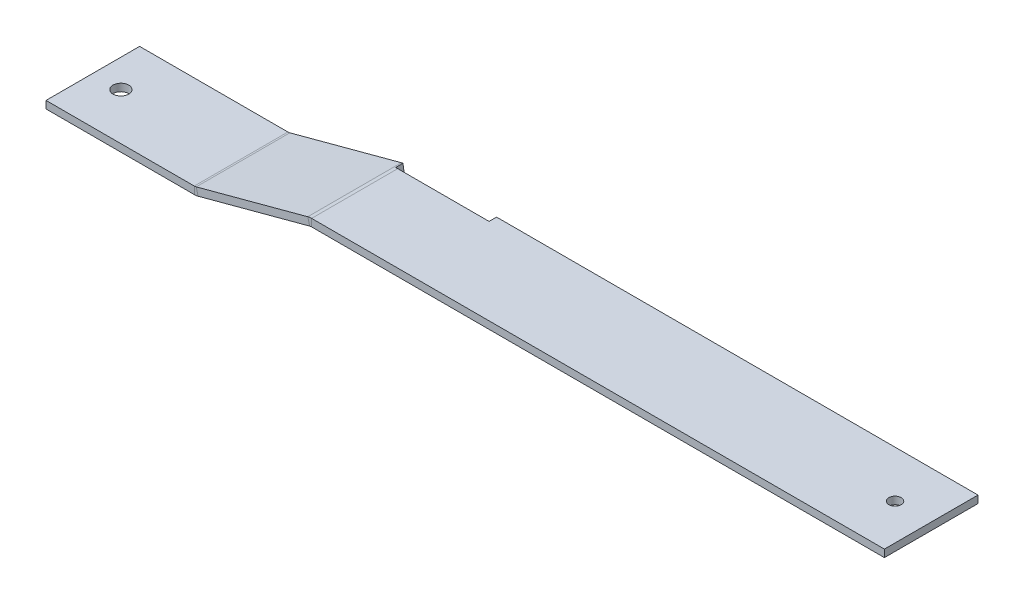
ISO-10303-21;
HEADER;
FILE_DESCRIPTION(('STEP AP214'),'2;1');
FILE_NAME('part.step','',(''),(''),'','','');
FILE_SCHEMA(('AUTOMOTIVE_DESIGN { 1 0 10303 214 1 1 1 1 }'));
ENDSEC;
DATA;
#1=APPLICATION_CONTEXT('core data for automotive mechanical design processes');
#2=APPLICATION_PROTOCOL_DEFINITION('international standard','automotive_design',2000,#1);
#3=PRODUCT_CONTEXT('',#1,'mechanical');
#4=PRODUCT('Part','Part','',(#3));
#5=PRODUCT_RELATED_PRODUCT_CATEGORY('part','',(#4));
#6=PRODUCT_DEFINITION_FORMATION('','',#4);
#7=PRODUCT_DEFINITION_CONTEXT('part definition',#1,'design');
#8=PRODUCT_DEFINITION('design','',#6,#7);
#9=PRODUCT_DEFINITION_SHAPE('','',#8);
#10=(LENGTH_UNIT() NAMED_UNIT(*) SI_UNIT(.MILLI.,.METRE.));
#11=(NAMED_UNIT(*) PLANE_ANGLE_UNIT() SI_UNIT($,.RADIAN.));
#12=(NAMED_UNIT(*) SI_UNIT($,.STERADIAN.) SOLID_ANGLE_UNIT());
#13=UNCERTAINTY_MEASURE_WITH_UNIT(LENGTH_MEASURE(1.E-05),#10,'distance_accuracy_value','');
#14=(GEOMETRIC_REPRESENTATION_CONTEXT(3) GLOBAL_UNCERTAINTY_ASSIGNED_CONTEXT((#13)) GLOBAL_UNIT_ASSIGNED_CONTEXT((#10,
#11,#12)) REPRESENTATION_CONTEXT('',''));
#15=CARTESIAN_POINT('',(0.,0.,0.));
#16=DIRECTION('',(0.,0.,1.));
#17=DIRECTION('',(1.,0.,0.));
#18=AXIS2_PLACEMENT_3D('',#15,#16,#17);
#19=CARTESIAN_POINT('',(-41.555842431062,4.205383129343,-12.5));
#20=DIRECTION('',(0.,0.,1.));
#21=DIRECTION('',(1.,0.,0.));
#22=AXIS2_PLACEMENT_3D('',#19,#20,#21);
#23=PLANE('',#22);
#24=CARTESIAN_POINT('',(-41.555842431062,4.205383129343,-12.5));
#25=DIRECTION('',(0.,0.,1.));
#26=DIRECTION('',(1.,0.,0.));
#27=AXIS2_PLACEMENT_3D('',#24,#25,#26);
#28=CIRCLE('',#27,3.98);
#29=CARTESIAN_POINT('',(-42.58594223057,8.04976791797349,-12.5));
#30=VERTEX_POINT('',#29);
#31=CARTESIAN_POINT('',(-42.1521992946053,8.14045091672669,-12.5));
#32=VERTEX_POINT('',#31);
#33=EDGE_CURVE('E178',#30,#32,#28,.F.);
#34=ORIENTED_EDGE('',*,*,#33,.T.);
#35=DIRECTION('',(0.149838407925458,-0.988710499342636,0.));
#36=VECTOR('',#35,1.);
#37=CARTESIAN_POINT('',(-41.8555192469129,6.18280412802827,-12.5));
#38=LINE('',#37,#36);
#39=CARTESIAN_POINT('',(-41.8555192469129,6.18280412802827,-12.5));
#40=VERTEX_POINT('',#39);
#41=EDGE_CURVE('E163',#32,#40,#38,.T.);
#42=ORIENTED_EDGE('',*,*,#41,.T.);
#43=CARTESIAN_POINT('',(-41.555842431062,4.205383129343,-12.5));
#44=DIRECTION('',(0.,0.,-1.));
#45=DIRECTION('',(1.,0.,0.));
#46=AXIS2_PLACEMENT_3D('',#43,#44,#45);
#47=CIRCLE('',#46,2.);
#48=CARTESIAN_POINT('',(-42.0734805212671,6.13723478192113,-12.5));
#49=VERTEX_POINT('',#48);
#50=EDGE_CURVE('E189',#49,#40,#47,.T.);
#51=ORIENTED_EDGE('',*,*,#50,.F.);
#52=DIRECTION('',(0.258819045102521,-0.965925826289068,0.));
#53=VECTOR('',#52,1.);
#54=CARTESIAN_POINT('',(-42.0734805212671,6.13723478192112,-12.5));
#55=LINE('',#54,#53);
#56=EDGE_CURVE('E186',#30,#49,#55,.T.);
#57=ORIENTED_EDGE('',*,*,#56,.F.);
#58=EDGE_LOOP('',(#34,#42,#51,#57));
#59=FACE_BOUND('',#58,.T.);
#60=ADVANCED_FACE('F47',(#59),#23,.F.);
#61=CARTESIAN_POINT('',(-41.555842431062,4.20538312934299,-25.1213663945543));
#62=DIRECTION('',(0.,0.,1.));
#63=DIRECTION('',(1.,0.,0.));
#64=AXIS2_PLACEMENT_3D('',#61,#62,#63);
#65=CYLINDRICAL_SURFACE('',#64,2.);
#66=DIRECTION('',(0.,0.,1.));
#67=VECTOR('',#66,1.);
#68=CARTESIAN_POINT('',(-41.8555192469129,6.18280412802827,-12.5));
#69=LINE('',#68,#67);
#70=CARTESIAN_POINT('',(-41.8555192469129,6.18280412802827,-10.5));
#71=VERTEX_POINT('',#70);
#72=EDGE_CURVE('E169',#40,#71,#69,.T.);
#73=ORIENTED_EDGE('',*,*,#72,.T.);
#74=CARTESIAN_POINT('',(-41.555842431062,4.205383129343,-10.5));
#75=DIRECTION('',(0.,0.,-1.));
#76=DIRECTION('',(-1.,0.,0.));
#77=AXIS2_PLACEMENT_3D('',#74,#75,#76);
#78=CIRCLE('',#77,2.);
#79=CARTESIAN_POINT('',(-41.555842431062,6.205383129343,-10.5));
#80=VERTEX_POINT('',#79);
#81=EDGE_CURVE('E659',#71,#80,#78,.T.);
#82=ORIENTED_EDGE('',*,*,#81,.T.);
#83=DIRECTION('',(0.,0.,1.));
#84=VECTOR('',#83,1.);
#85=CARTESIAN_POINT('',(-41.555842431062,6.205383129343,0.));
#86=LINE('',#85,#84);
#87=CARTESIAN_POINT('',(-41.555842431062,6.205383129343,12.5));
#88=VERTEX_POINT('',#87);
#89=EDGE_CURVE('E270',#80,#88,#86,.T.);
#90=ORIENTED_EDGE('',*,*,#89,.T.);
#91=CARTESIAN_POINT('',(-41.555842431062,4.205383129343,12.5));
#92=DIRECTION('',(0.,0.,1.));
#93=DIRECTION('',(-1.,0.,0.));
#94=AXIS2_PLACEMENT_3D('',#91,#92,#93);
#95=CIRCLE('',#94,2.);
#96=CARTESIAN_POINT('',(-42.073480521267,6.13723478192115,12.5));
#97=VERTEX_POINT('',#96);
#98=EDGE_CURVE('E195',#88,#97,#95,.T.);
#99=ORIENTED_EDGE('',*,*,#98,.T.);
#100=DIRECTION('',(0.,0.,1.));
#101=VECTOR('',#100,1.);
#102=CARTESIAN_POINT('',(-42.0734805212671,6.13723478192114,0.));
#103=LINE('',#102,#101);
#104=EDGE_CURVE('E256',#49,#97,#103,.T.);
#105=ORIENTED_EDGE('',*,*,#104,.F.);
#106=ORIENTED_EDGE('',*,*,#50,.T.);
#107=EDGE_LOOP('',(#73,#82,#90,#99,#105,#106));
#108=FACE_BOUND('',#107,.T.);
#109=ADVANCED_FACE('F307',(#108),#65,.F.);
#110=CARTESIAN_POINT('',(-41.555842431062,4.20538312934299,-25.1213663945543));
#111=DIRECTION('',(0.,0.,1.));
#112=DIRECTION('',(1.,0.,0.));
#113=AXIS2_PLACEMENT_3D('',#110,#111,#112);
#114=CYLINDRICAL_SURFACE('',#113,3.98);
#115=CARTESIAN_POINT('',(-41.555842431062,4.205383129343,-10.5));
#116=DIRECTION('',(0.,0.,1.));
#117=DIRECTION('',(1.,0.,0.));
#118=AXIS2_PLACEMENT_3D('',#115,#116,#117);
#119=CIRCLE('',#118,3.98);
#120=CARTESIAN_POINT('',(-42.1521992946053,8.14045091672669,-10.5));
#121=VERTEX_POINT('',#120);
#122=CARTESIAN_POINT('',(-41.555842431062,8.185383129343,-10.5));
#123=VERTEX_POINT('',#122);
#124=EDGE_CURVE('E182',#121,#123,#119,.F.);
#125=ORIENTED_EDGE('',*,*,#124,.F.);
#126=DIRECTION('',(0.,0.,1.));
#127=VECTOR('',#126,1.);
#128=CARTESIAN_POINT('',(-42.1521992946053,8.14045091672669,-25.1213663945543));
#129=LINE('',#128,#127);
#130=EDGE_CURVE('E166',#32,#121,#129,.T.);
#131=ORIENTED_EDGE('',*,*,#130,.F.);
#132=ORIENTED_EDGE('',*,*,#33,.F.);
#133=DIRECTION('',(0.,0.,1.));
#134=VECTOR('',#133,1.);
#135=CARTESIAN_POINT('',(-42.58594223057,8.04976791797349,0.));
#136=LINE('',#135,#134);
#137=CARTESIAN_POINT('',(-42.58594223057,8.0497679179735,12.5));
#138=VERTEX_POINT('',#137);
#139=EDGE_CURVE('E56',#30,#138,#136,.T.);
#140=ORIENTED_EDGE('',*,*,#139,.T.);
#141=CARTESIAN_POINT('',(-41.555842431062,4.205383129343,12.5));
#142=DIRECTION('',(0.,0.,1.));
#143=DIRECTION('',(1.,0.,0.));
#144=AXIS2_PLACEMENT_3D('',#141,#142,#143);
#145=CIRCLE('',#144,3.98);
#146=CARTESIAN_POINT('',(-41.555842431062,8.18538312934302,12.5));
#147=VERTEX_POINT('',#146);
#148=EDGE_CURVE('E72',#147,#138,#145,.T.);
#149=ORIENTED_EDGE('',*,*,#148,.F.);
#150=DIRECTION('',(0.,0.,1.));
#151=VECTOR('',#150,1.);
#152=CARTESIAN_POINT('',(-41.555842431062,8.18538312934301,0.));
#153=LINE('',#152,#151);
#154=EDGE_CURVE('E291',#123,#147,#153,.T.);
#155=ORIENTED_EDGE('',*,*,#154,.F.);
#156=EDGE_LOOP('',(#125,#131,#132,#140,#149,#155));
#157=FACE_BOUND('',#156,.T.);
#158=ADVANCED_FACE('F177',(#157),#114,.T.);
#159=CARTESIAN_POINT('',(-1.06862260058143,6.20538312934301,0.));
#160=DIRECTION('',(0.,-1.,0.));
#161=DIRECTION('',(0.,0.,-1.));
#162=AXIS2_PLACEMENT_3D('',#159,#160,#161);
#163=PLANE('',#162);
#164=CARTESIAN_POINT('',(101.775,6.20538312934301,0.));
#165=DIRECTION('',(0.,-1.,0.));
#166=DIRECTION('',(0.,0.,-1.));
#167=AXIS2_PLACEMENT_3D('',#164,#165,#166);
#168=CIRCLE('',#167,1.65);
#169=CARTESIAN_POINT('',(101.775,6.20538312934301,-1.64999999999999));
#170=VERTEX_POINT('',#169);
#171=EDGE_CURVE('E281',#170,#170,#168,.T.);
#172=ORIENTED_EDGE('',*,*,#171,.F.);
#173=EDGE_LOOP('',(#172));
#174=FACE_BOUND('',#173,.T.);
#175=ORIENTED_EDGE('',*,*,#89,.F.);
#176=DIRECTION('',(1.,0.,0.));
#177=VECTOR('',#176,1.);
#178=CARTESIAN_POINT('',(-1.06862260058145,6.20538312934301,-10.5));
#179=LINE('',#178,#177);
#180=CARTESIAN_POINT('',(-17.1521992946053,6.20538312934301,-10.5));
#181=VERTEX_POINT('',#180);
#182=EDGE_CURVE('E676',#181,#80,#179,.F.);
#183=ORIENTED_EDGE('',*,*,#182,.F.);
#184=DIRECTION('',(0.,0.,-1.));
#185=VECTOR('',#184,1.);
#186=CARTESIAN_POINT('',(-17.1521992946053,6.20538312934301,0.));
#187=LINE('',#186,#185);
#188=CARTESIAN_POINT('',(-17.1521992946053,6.205383129343,-12.5));
#189=VERTEX_POINT('',#188);
#190=EDGE_CURVE('E671',#181,#189,#187,.T.);
#191=ORIENTED_EDGE('',*,*,#190,.T.);
#192=DIRECTION('',(-1.,0.,0.));
#193=VECTOR('',#192,1.);
#194=CARTESIAN_POINT('',(-113.568622600581,6.205383129343,-12.5));
#195=LINE('',#194,#193);
#196=CARTESIAN_POINT('',(111.431377399419,6.205383129343,-12.5));
#197=VERTEX_POINT('',#196);
#198=EDGE_CURVE('E296',#197,#189,#195,.T.);
#199=ORIENTED_EDGE('',*,*,#198,.F.);
#200=DIRECTION('',(0.,0.,-1.));
#201=VECTOR('',#200,1.);
#202=CARTESIAN_POINT('',(111.431377399419,6.20538312934301,12.5));
#203=LINE('',#202,#201);
#204=CARTESIAN_POINT('',(111.431377399419,6.20538312934301,12.5));
#205=VERTEX_POINT('',#204);
#206=EDGE_CURVE('E301',#205,#197,#203,.T.);
#207=ORIENTED_EDGE('',*,*,#206,.F.);
#208=DIRECTION('',(1.,0.,0.));
#209=VECTOR('',#208,1.);
#210=CARTESIAN_POINT('',(111.431377399419,6.20538312934301,12.5));
#211=LINE('',#210,#209);
#212=EDGE_CURVE('E192',#88,#205,#211,.T.);
#213=ORIENTED_EDGE('',*,*,#212,.F.);
#214=EDGE_LOOP('',(#175,#183,#191,#199,#207,#213));
#215=FACE_BOUND('',#214,.T.);
#216=ADVANCED_FACE('F381',(#174,#215),#163,.T.);
#217=CARTESIAN_POINT('',(-113.568622600581,6.205383129343,-12.5));
#218=DIRECTION('',(0.,0.,-1.));
#219=DIRECTION('',(-1.,0.,0.));
#220=AXIS2_PLACEMENT_3D('',#217,#218,#219);
#221=PLANE('',#220);
#222=ORIENTED_EDGE('',*,*,#198,.T.);
#223=DIRECTION('',(0.,1.,0.));
#224=VECTOR('',#223,1.);
#225=CARTESIAN_POINT('',(-17.1521992946053,8.18538312934301,-12.5));
#226=LINE('',#225,#224);
#227=CARTESIAN_POINT('',(-17.1521992946053,8.185383129343,-12.5));
#228=VERTEX_POINT('',#227);
#229=EDGE_CURVE('E669',#228,#189,#226,.F.);
#230=ORIENTED_EDGE('',*,*,#229,.F.);
#231=DIRECTION('',(-1.,0.,0.));
#232=VECTOR('',#231,1.);
#233=CARTESIAN_POINT('',(-113.568622600581,8.185383129343,-12.5));
#234=LINE('',#233,#232);
#235=CARTESIAN_POINT('',(111.431377399418,8.185383129343,-12.5));
#236=VERTEX_POINT('',#235);
#237=EDGE_CURVE('E293',#236,#228,#234,.T.);
#238=ORIENTED_EDGE('',*,*,#237,.F.);
#239=DIRECTION('',(0.,1.,0.));
#240=VECTOR('',#239,1.);
#241=CARTESIAN_POINT('',(111.431377399419,6.205383129343,-12.5));
#242=LINE('',#241,#240);
#243=EDGE_CURVE('E299',#197,#236,#242,.T.);
#244=ORIENTED_EDGE('',*,*,#243,.F.);
#245=EDGE_LOOP('',(#222,#230,#238,#244));
#246=FACE_BOUND('',#245,.T.);
#247=ADVANCED_FACE('F388',(#246),#221,.T.);
#248=CARTESIAN_POINT('',(-1.06862260058143,8.18538312934301,0.));
#249=DIRECTION('',(0.,-1.,0.));
#250=DIRECTION('',(0.,0.,-1.));
#251=AXIS2_PLACEMENT_3D('',#248,#249,#250);
#252=PLANE('',#251);
#253=CARTESIAN_POINT('',(101.775,8.18538312934301,0.));
#254=DIRECTION('',(0.,-1.,0.));
#255=DIRECTION('',(0.,0.,-1.));
#256=AXIS2_PLACEMENT_3D('',#253,#254,#255);
#257=CIRCLE('',#256,1.65);
#258=CARTESIAN_POINT('',(101.775,8.18538312934301,-1.64999999999999));
#259=VERTEX_POINT('',#258);
#260=EDGE_CURVE('E51',#259,#259,#257,.T.);
#261=ORIENTED_EDGE('',*,*,#260,.T.);
#262=EDGE_LOOP('',(#261));
#263=FACE_BOUND('',#262,.T.);
#264=DIRECTION('',(-1.,0.,0.));
#265=VECTOR('',#264,1.);
#266=CARTESIAN_POINT('',(-1.06862260058145,8.18538312934301,-10.5));
#267=LINE('',#266,#265);
#268=CARTESIAN_POINT('',(-17.1521992946053,8.185383129343,-10.5));
#269=VERTEX_POINT('',#268);
#270=EDGE_CURVE('E64',#269,#123,#267,.T.);
#271=ORIENTED_EDGE('',*,*,#270,.T.);
#272=ORIENTED_EDGE('',*,*,#154,.T.);
#273=DIRECTION('',(1.,0.,0.));
#274=VECTOR('',#273,1.);
#275=CARTESIAN_POINT('',(111.431377399418,8.18538312934301,12.5));
#276=LINE('',#275,#274);
#277=CARTESIAN_POINT('',(111.431377399418,8.18538312934301,12.5));
#278=VERTEX_POINT('',#277);
#279=EDGE_CURVE('E289',#147,#278,#276,.T.);
#280=ORIENTED_EDGE('',*,*,#279,.T.);
#281=DIRECTION('',(0.,0.,-1.));
#282=VECTOR('',#281,1.);
#283=CARTESIAN_POINT('',(111.431377399418,8.18538312934301,12.5));
#284=LINE('',#283,#282);
#285=EDGE_CURVE('E286',#278,#236,#284,.T.);
#286=ORIENTED_EDGE('',*,*,#285,.T.);
#287=ORIENTED_EDGE('',*,*,#237,.T.);
#288=DIRECTION('',(0.,0.,-1.));
#289=VECTOR('',#288,1.);
#290=CARTESIAN_POINT('',(-17.1521992946053,8.18538312934299,-10.5));
#291=LINE('',#290,#289);
#292=EDGE_CURVE('E667',#269,#228,#291,.T.);
#293=ORIENTED_EDGE('',*,*,#292,.F.);
#294=EDGE_LOOP('',(#271,#272,#280,#286,#287,#293));
#295=FACE_BOUND('',#294,.T.);
#296=ADVANCED_FACE('F354',(#263,#295),#252,.F.);
#297=CARTESIAN_POINT('',(106.456933787203,45.9358393473358,12.5));
#298=DIRECTION('',(0.,0.,1.));
#299=DIRECTION('',(0.965925826289068,0.258819045102521,0.));
#300=AXIS2_PLACEMENT_3D('',#297,#298,#299);
#301=PLANE('',#300);
#302=DIRECTION('',(0.965925826289068,0.258819045102521,0.));
#303=VECTOR('',#302,1.);
#304=CARTESIAN_POINT('',(106.456933787203,45.9358393473358,12.5));
#305=LINE('',#304,#303);
#306=CARTESIAN_POINT('',(-71.8612902852517,-1.84438478863048,12.5));
#307=VERTEX_POINT('',#306);
#308=EDGE_CURVE('E247',#307,#97,#305,.T.);
#309=ORIENTED_EDGE('',*,*,#308,.T.);
#310=DIRECTION('',(-0.258819045102521,0.965925826289068,0.));
#311=VECTOR('',#310,1.);
#312=CARTESIAN_POINT('',(-42.0734805212671,6.13723478192115,12.5));
#313=LINE('',#312,#311);
#314=EDGE_CURVE('E12',#97,#138,#313,.T.);
#315=ORIENTED_EDGE('',*,*,#314,.T.);
#316=DIRECTION('',(0.965925826289068,0.258819045102521,0.));
#317=VECTOR('',#316,1.);
#318=CARTESIAN_POINT('',(105.9444720779,47.8483724833882,12.5));
#319=LINE('',#318,#317);
#320=CARTESIAN_POINT('',(-72.3737519945547,0.0681483474218626,12.5));
#321=VERTEX_POINT('',#320);
#322=EDGE_CURVE('E264',#321,#138,#319,.T.);
#323=ORIENTED_EDGE('',*,*,#322,.F.);
#324=DIRECTION('',(-0.258819045102521,0.965925826289068,0.));
#325=VECTOR('',#324,1.);
#326=CARTESIAN_POINT('',(-71.8612902852517,-1.84438478863049,12.5));
#327=LINE('',#326,#325);
#328=EDGE_CURVE('E246',#307,#321,#327,.T.);
#329=ORIENTED_EDGE('',*,*,#328,.F.);
#330=EDGE_LOOP('',(#309,#315,#323,#329));
#331=FACE_BOUND('',#330,.T.);
#332=ADVANCED_FACE('F49',(#331),#301,.T.);
#333=CARTESIAN_POINT('',(-110.876377127837,-12.2984458007315,-12.5));
#334=DIRECTION('',(0.,0.,-1.));
#335=DIRECTION('',(-0.965925826289068,-0.258819045102521,0.));
#336=AXIS2_PLACEMENT_3D('',#333,#334,#335);
#337=PLANE('',#336);
#338=DIRECTION('',(-0.965925826289068,-0.258819045102521,0.));
#339=VECTOR('',#338,1.);
#340=CARTESIAN_POINT('',(-111.38883883714,-10.3859126646791,-12.5));
#341=LINE('',#340,#339);
#342=CARTESIAN_POINT('',(-72.3737519945547,0.0681483474218522,-12.5));
#343=VERTEX_POINT('',#342);
#344=EDGE_CURVE('E213',#30,#343,#341,.T.);
#345=ORIENTED_EDGE('',*,*,#344,.F.);
#346=ORIENTED_EDGE('',*,*,#56,.T.);
#347=DIRECTION('',(-0.965925826289068,-0.258819045102521,0.));
#348=VECTOR('',#347,1.);
#349=CARTESIAN_POINT('',(-110.876377127837,-12.2984458007315,-12.5));
#350=LINE('',#349,#348);
#351=CARTESIAN_POINT('',(-71.8612902852517,-1.8443847886305,-12.5));
#352=VERTEX_POINT('',#351);
#353=EDGE_CURVE('E263',#49,#352,#350,.T.);
#354=ORIENTED_EDGE('',*,*,#353,.T.);
#355=DIRECTION('',(0.258819045102521,-0.965925826289068,0.));
#356=VECTOR('',#355,1.);
#357=CARTESIAN_POINT('',(-71.8612902852517,-1.8443847886305,-12.5));
#358=LINE('',#357,#356);
#359=EDGE_CURVE('E253',#343,#352,#358,.T.);
#360=ORIENTED_EDGE('',*,*,#359,.F.);
#361=EDGE_LOOP('',(#345,#346,#354,#360));
#362=FACE_BOUND('',#361,.T.);
#363=ADVANCED_FACE('F348',(#362),#337,.T.);
#364=CARTESIAN_POINT('',(-2.20972167031717,16.8186967733022,0.));
#365=DIRECTION('',(0.258819045102521,-0.965925826289068,0.));
#366=DIRECTION('',(0.,0.,-1.));
#367=AXIS2_PLACEMENT_3D('',#364,#365,#366);
#368=PLANE('',#367);
#369=ORIENTED_EDGE('',*,*,#353,.F.);
#370=ORIENTED_EDGE('',*,*,#104,.T.);
#371=ORIENTED_EDGE('',*,*,#308,.F.);
#372=DIRECTION('',(0.,0.,1.));
#373=VECTOR('',#372,1.);
#374=CARTESIAN_POINT('',(-71.8612902852517,-1.8443847886305,0.));
#375=LINE('',#374,#373);
#376=EDGE_CURVE('E243',#352,#307,#375,.T.);
#377=ORIENTED_EDGE('',*,*,#376,.F.);
#378=EDGE_LOOP('',(#369,#370,#371,#377));
#379=FACE_BOUND('',#378,.T.);
#380=ADVANCED_FACE('F314',(#379),#368,.T.);
#381=CARTESIAN_POINT('',(-2.72218337962016,18.7312299093546,0.));
#382=DIRECTION('',(0.258819045102521,-0.965925826289068,0.));
#383=DIRECTION('',(0.,0.,-1.));
#384=AXIS2_PLACEMENT_3D('',#381,#382,#383);
#385=PLANE('',#384);
#386=ORIENTED_EDGE('',*,*,#139,.F.);
#387=ORIENTED_EDGE('',*,*,#344,.T.);
#388=DIRECTION('',(0.,0.,1.));
#389=VECTOR('',#388,1.);
#390=CARTESIAN_POINT('',(-72.3737519945547,0.0681483474218557,0.));
#391=LINE('',#390,#389);
#392=EDGE_CURVE('E250',#343,#321,#391,.T.);
#393=ORIENTED_EDGE('',*,*,#392,.T.);
#394=ORIENTED_EDGE('',*,*,#322,.T.);
#395=EDGE_LOOP('',(#386,#387,#393,#394));
#396=FACE_BOUND('',#395,.T.);
#397=ADVANCED_FACE('F351',(#396),#385,.F.);
#398=CARTESIAN_POINT('',(-112.5,-1.98,12.5));
#399=DIRECTION('',(-1.,0.,0.));
#400=DIRECTION('',(0.,0.,1.));
#401=AXIS2_PLACEMENT_3D('',#398,#399,#400);
#402=PLANE('',#401);
#403=DIRECTION('',(0.,0.,1.));
#404=VECTOR('',#403,1.);
#405=CARTESIAN_POINT('',(-112.5,0.,12.5));
#406=LINE('',#405,#404);
#407=CARTESIAN_POINT('',(-112.5,0.,-12.5));
#408=VERTEX_POINT('',#407);
#409=CARTESIAN_POINT('',(-112.5,0.,12.5));
#410=VERTEX_POINT('',#409);
#411=EDGE_CURVE('E222',#408,#410,#406,.T.);
#412=ORIENTED_EDGE('',*,*,#411,.F.);
#413=DIRECTION('',(0.,1.,0.));
#414=VECTOR('',#413,1.);
#415=CARTESIAN_POINT('',(-112.5,-1.98,-12.5));
#416=LINE('',#415,#414);
#417=CARTESIAN_POINT('',(-112.5,-1.98,-12.5));
#418=VERTEX_POINT('',#417);
#419=EDGE_CURVE('E210',#418,#408,#416,.T.);
#420=ORIENTED_EDGE('',*,*,#419,.F.);
#421=DIRECTION('',(0.,0.,1.));
#422=VECTOR('',#421,1.);
#423=CARTESIAN_POINT('',(-112.5,-1.98,12.5));
#424=LINE('',#423,#422);
#425=CARTESIAN_POINT('',(-112.5,-1.98,12.5));
#426=VERTEX_POINT('',#425);
#427=EDGE_CURVE('E238',#418,#426,#424,.T.);
#428=ORIENTED_EDGE('',*,*,#427,.T.);
#429=DIRECTION('',(0.,1.,0.));
#430=VECTOR('',#429,1.);
#431=CARTESIAN_POINT('',(-112.5,-1.98,12.5));
#432=LINE('',#431,#430);
#433=EDGE_CURVE('E236',#426,#410,#432,.T.);
#434=ORIENTED_EDGE('',*,*,#433,.T.);
#435=EDGE_LOOP('',(#412,#420,#428,#434));
#436=FACE_BOUND('',#435,.T.);
#437=ADVANCED_FACE('F463',(#436),#402,.T.);
#438=CARTESIAN_POINT('',(0.,-1.98,0.));
#439=DIRECTION('',(0.,-1.,0.));
#440=DIRECTION('',(0.,0.,-1.));
#441=AXIS2_PLACEMENT_3D('',#438,#439,#440);
#442=PLANE('',#441);
#443=CARTESIAN_POINT('',(-105.,-1.98,0.));
#444=DIRECTION('',(0.,-1.,0.));
#445=DIRECTION('',(0.,0.,-1.));
#446=AXIS2_PLACEMENT_3D('',#443,#444,#445);
#447=CIRCLE('',#446,2.1);
#448=CARTESIAN_POINT('',(-105.,-1.98,-2.1));
#449=VERTEX_POINT('',#448);
#450=EDGE_CURVE('E271',#449,#449,#447,.T.);
#451=ORIENTED_EDGE('',*,*,#450,.F.);
#452=EDGE_LOOP('',(#451));
#453=FACE_BOUND('',#452,.T.);
#454=DIRECTION('',(-1.,0.,0.));
#455=VECTOR('',#454,1.);
#456=CARTESIAN_POINT('',(-112.5,-1.98,-12.5));
#457=LINE('',#456,#455);
#458=CARTESIAN_POINT('',(-72.8913900847598,-1.98,-12.5));
#459=VERTEX_POINT('',#458);
#460=EDGE_CURVE('E214',#459,#418,#457,.T.);
#461=ORIENTED_EDGE('',*,*,#460,.F.);
#462=DIRECTION('',(0.,0.,1.));
#463=VECTOR('',#462,1.);
#464=CARTESIAN_POINT('',(-72.8913900847598,-1.98,0.));
#465=LINE('',#464,#463);
#466=CARTESIAN_POINT('',(-72.8913900847598,-1.98,12.5));
#467=VERTEX_POINT('',#466);
#468=EDGE_CURVE('E233',#459,#467,#465,.T.);
#469=ORIENTED_EDGE('',*,*,#468,.T.);
#470=DIRECTION('',(1.,0.,0.));
#471=VECTOR('',#470,1.);
#472=CARTESIAN_POINT('',(112.5,-1.98,12.5));
#473=LINE('',#472,#471);
#474=EDGE_CURVE('E230',#426,#467,#473,.T.);
#475=ORIENTED_EDGE('',*,*,#474,.F.);
#476=ORIENTED_EDGE('',*,*,#427,.F.);
#477=EDGE_LOOP('',(#461,#469,#475,#476));
#478=FACE_BOUND('',#477,.T.);
#479=ADVANCED_FACE('F339',(#453,#478),#442,.T.);
#480=CARTESIAN_POINT('',(112.5,-1.98,12.5));
#481=DIRECTION('',(0.,0.,1.));
#482=DIRECTION('',(1.,0.,0.));
#483=AXIS2_PLACEMENT_3D('',#480,#481,#482);
#484=PLANE('',#483);
#485=ORIENTED_EDGE('',*,*,#474,.T.);
#486=DIRECTION('',(0.,1.,0.));
#487=VECTOR('',#486,1.);
#488=CARTESIAN_POINT('',(-72.8913900847598,-1.98,12.5));
#489=LINE('',#488,#487);
#490=CARTESIAN_POINT('',(-72.8913900847598,0.,12.5));
#491=VERTEX_POINT('',#490);
#492=EDGE_CURVE('E227',#467,#491,#489,.T.);
#493=ORIENTED_EDGE('',*,*,#492,.T.);
#494=DIRECTION('',(1.,0.,0.));
#495=VECTOR('',#494,1.);
#496=CARTESIAN_POINT('',(112.5,0.,12.5));
#497=LINE('',#496,#495);
#498=EDGE_CURVE('E219',#410,#491,#497,.T.);
#499=ORIENTED_EDGE('',*,*,#498,.F.);
#500=ORIENTED_EDGE('',*,*,#433,.F.);
#501=EDGE_LOOP('',(#485,#493,#499,#500));
#502=FACE_BOUND('',#501,.T.);
#503=ADVANCED_FACE('F332',(#502),#484,.T.);
#504=CARTESIAN_POINT('',(0.,0.,0.));
#505=DIRECTION('',(0.,-1.,0.));
#506=DIRECTION('',(0.,0.,-1.));
#507=AXIS2_PLACEMENT_3D('',#504,#505,#506);
#508=PLANE('',#507);
#509=CARTESIAN_POINT('',(-105.,0.,0.));
#510=DIRECTION('',(0.,-1.,0.));
#511=DIRECTION('',(0.,0.,-1.));
#512=AXIS2_PLACEMENT_3D('',#509,#510,#511);
#513=CIRCLE('',#512,2.1);
#514=CARTESIAN_POINT('',(-105.,0.,-2.1));
#515=VERTEX_POINT('',#514);
#516=EDGE_CURVE('E268',#515,#515,#513,.T.);
#517=ORIENTED_EDGE('',*,*,#516,.T.);
#518=EDGE_LOOP('',(#517));
#519=FACE_BOUND('',#518,.T.);
#520=DIRECTION('',(0.,0.,1.));
#521=VECTOR('',#520,1.);
#522=CARTESIAN_POINT('',(-72.8913900847598,0.,0.));
#523=LINE('',#522,#521);
#524=CARTESIAN_POINT('',(-72.8913900847598,0.,-12.5));
#525=VERTEX_POINT('',#524);
#526=EDGE_CURVE('E205',#525,#491,#523,.T.);
#527=ORIENTED_EDGE('',*,*,#526,.F.);
#528=DIRECTION('',(-1.,0.,0.));
#529=VECTOR('',#528,1.);
#530=CARTESIAN_POINT('',(-112.5,0.,-12.5));
#531=LINE('',#530,#529);
#532=EDGE_CURVE('E225',#525,#408,#531,.T.);
#533=ORIENTED_EDGE('',*,*,#532,.T.);
#534=ORIENTED_EDGE('',*,*,#411,.T.);
#535=ORIENTED_EDGE('',*,*,#498,.T.);
#536=EDGE_LOOP('',(#527,#533,#534,#535));
#537=FACE_BOUND('',#536,.T.);
#538=ADVANCED_FACE('F329',(#519,#537),#508,.F.);
#539=CARTESIAN_POINT('',(-112.5,-1.98,-12.5));
#540=DIRECTION('',(0.,0.,-1.));
#541=DIRECTION('',(-1.,0.,0.));
#542=AXIS2_PLACEMENT_3D('',#539,#540,#541);
#543=PLANE('',#542);
#544=ORIENTED_EDGE('',*,*,#532,.F.);
#545=DIRECTION('',(0.,-1.,0.));
#546=VECTOR('',#545,1.);
#547=CARTESIAN_POINT('',(-72.8913900847598,-1.98,-12.5));
#548=LINE('',#547,#546);
#549=EDGE_CURVE('E216',#525,#459,#548,.T.);
#550=ORIENTED_EDGE('',*,*,#549,.T.);
#551=ORIENTED_EDGE('',*,*,#460,.T.);
#552=ORIENTED_EDGE('',*,*,#419,.T.);
#553=EDGE_LOOP('',(#544,#550,#551,#552));
#554=FACE_BOUND('',#553,.T.);
#555=ADVANCED_FACE('F343',(#554),#543,.T.);
#556=CARTESIAN_POINT('',(-72.8913900847598,2.,-12.5));
#557=DIRECTION('',(0.,0.,-1.));
#558=DIRECTION('',(-1.,0.,0.));
#559=AXIS2_PLACEMENT_3D('',#556,#557,#558);
#560=PLANE('',#559);
#561=ORIENTED_EDGE('',*,*,#549,.F.);
#562=CARTESIAN_POINT('',(-72.8913900847598,2.,-12.5));
#563=DIRECTION('',(0.,0.,1.));
#564=DIRECTION('',(1.,0.,0.));
#565=AXIS2_PLACEMENT_3D('',#562,#563,#564);
#566=CIRCLE('',#565,2.);
#567=EDGE_CURVE('E206',#525,#343,#566,.T.);
#568=ORIENTED_EDGE('',*,*,#567,.T.);
#569=ORIENTED_EDGE('',*,*,#359,.T.);
#570=CARTESIAN_POINT('',(-72.8913900847598,2.,-12.5));
#571=DIRECTION('',(0.,0.,1.));
#572=DIRECTION('',(-1.,0.,0.));
#573=AXIS2_PLACEMENT_3D('',#570,#571,#572);
#574=CIRCLE('',#573,3.98);
#575=EDGE_CURVE('E198',#459,#352,#574,.T.);
#576=ORIENTED_EDGE('',*,*,#575,.F.);
#577=EDGE_LOOP('',(#561,#568,#569,#576));
#578=FACE_BOUND('',#577,.T.);
#579=ADVANCED_FACE('F345',(#578),#560,.T.);
#580=CARTESIAN_POINT('',(-72.8913900847598,2.,12.5));
#581=DIRECTION('',(0.,0.,1.));
#582=DIRECTION('',(1.,0.,0.));
#583=AXIS2_PLACEMENT_3D('',#580,#581,#582);
#584=PLANE('',#583);
#585=CARTESIAN_POINT('',(-72.8913900847598,2.,12.5));
#586=DIRECTION('',(0.,0.,1.));
#587=DIRECTION('',(1.,0.,0.));
#588=AXIS2_PLACEMENT_3D('',#585,#586,#587);
#589=CIRCLE('',#588,2.);
#590=EDGE_CURVE('E202',#321,#491,#589,.F.);
#591=ORIENTED_EDGE('',*,*,#590,.T.);
#592=ORIENTED_EDGE('',*,*,#492,.F.);
#593=CARTESIAN_POINT('',(-72.8913900847598,2.,12.5));
#594=DIRECTION('',(0.,0.,-1.));
#595=DIRECTION('',(1.,0.,0.));
#596=AXIS2_PLACEMENT_3D('',#593,#594,#595);
#597=CIRCLE('',#596,3.98);
#598=EDGE_CURVE('E201',#307,#467,#597,.T.);
#599=ORIENTED_EDGE('',*,*,#598,.F.);
#600=ORIENTED_EDGE('',*,*,#328,.T.);
#601=EDGE_LOOP('',(#591,#592,#599,#600));
#602=FACE_BOUND('',#601,.T.);
#603=ADVANCED_FACE('F320',(#602),#584,.T.);
#604=CARTESIAN_POINT('',(-72.8913900847598,2.,-25.090499094155));
#605=DIRECTION('',(0.,0.,1.));
#606=DIRECTION('',(1.,0.,0.));
#607=AXIS2_PLACEMENT_3D('',#604,#605,#606);
#608=CYLINDRICAL_SURFACE('',#607,3.98);
#609=ORIENTED_EDGE('',*,*,#376,.T.);
#610=ORIENTED_EDGE('',*,*,#598,.T.);
#611=ORIENTED_EDGE('',*,*,#468,.F.);
#612=ORIENTED_EDGE('',*,*,#575,.T.);
#613=EDGE_LOOP('',(#609,#610,#611,#612));
#614=FACE_BOUND('',#613,.T.);
#615=ADVANCED_FACE('F335',(#614),#608,.T.);
#616=CARTESIAN_POINT('',(-72.8913900847598,2.,-25.090499094155));
#617=DIRECTION('',(0.,0.,1.));
#618=DIRECTION('',(1.,0.,0.));
#619=AXIS2_PLACEMENT_3D('',#616,#617,#618);
#620=CYLINDRICAL_SURFACE('',#619,2.);
#621=ORIENTED_EDGE('',*,*,#392,.F.);
#622=ORIENTED_EDGE('',*,*,#567,.F.);
#623=ORIENTED_EDGE('',*,*,#526,.T.);
#624=ORIENTED_EDGE('',*,*,#590,.F.);
#625=EDGE_LOOP('',(#621,#622,#623,#624));
#626=FACE_BOUND('',#625,.T.);
#627=ADVANCED_FACE('F323',(#626),#620,.F.);
#628=CARTESIAN_POINT('',(-41.555842431062,4.205383129343,12.5));
#629=DIRECTION('',(0.,0.,-1.));
#630=DIRECTION('',(-1.,0.,0.));
#631=AXIS2_PLACEMENT_3D('',#628,#629,#630);
#632=PLANE('',#631);
#633=ORIENTED_EDGE('',*,*,#148,.T.);
#634=ORIENTED_EDGE('',*,*,#314,.F.);
#635=ORIENTED_EDGE('',*,*,#98,.F.);
#636=DIRECTION('',(0.,1.,0.));
#637=VECTOR('',#636,1.);
#638=CARTESIAN_POINT('',(-41.555842431062,6.20538312934302,12.5));
#639=LINE('',#638,#637);
#640=EDGE_CURVE('E274',#88,#147,#639,.T.);
#641=ORIENTED_EDGE('',*,*,#640,.T.);
#642=EDGE_LOOP('',(#633,#634,#635,#641));
#643=FACE_BOUND('',#642,.T.);
#644=ADVANCED_FACE('F361',(#643),#632,.F.);
#645=CARTESIAN_POINT('',(111.431377399419,6.20538312934301,12.5));
#646=DIRECTION('',(1.,0.,0.));
#647=DIRECTION('',(0.,0.,-1.));
#648=AXIS2_PLACEMENT_3D('',#645,#646,#647);
#649=PLANE('',#648);
#650=ORIENTED_EDGE('',*,*,#285,.F.);
#651=DIRECTION('',(0.,1.,0.));
#652=VECTOR('',#651,1.);
#653=CARTESIAN_POINT('',(111.431377399419,6.20538312934301,12.5));
#654=LINE('',#653,#652);
#655=EDGE_CURVE('E187',#205,#278,#654,.T.);
#656=ORIENTED_EDGE('',*,*,#655,.F.);
#657=ORIENTED_EDGE('',*,*,#206,.T.);
#658=ORIENTED_EDGE('',*,*,#243,.T.);
#659=EDGE_LOOP('',(#650,#656,#657,#658));
#660=FACE_BOUND('',#659,.T.);
#661=ADVANCED_FACE('F363',(#660),#649,.T.);
#662=CARTESIAN_POINT('',(111.431377399419,6.20538312934301,12.5));
#663=DIRECTION('',(0.,0.,1.));
#664=DIRECTION('',(1.,0.,0.));
#665=AXIS2_PLACEMENT_3D('',#662,#663,#664);
#666=PLANE('',#665);
#667=ORIENTED_EDGE('',*,*,#640,.F.);
#668=ORIENTED_EDGE('',*,*,#212,.T.);
#669=ORIENTED_EDGE('',*,*,#655,.T.);
#670=ORIENTED_EDGE('',*,*,#279,.F.);
#671=EDGE_LOOP('',(#667,#668,#669,#670));
#672=FACE_BOUND('',#671,.T.);
#673=ADVANCED_FACE('F357',(#672),#666,.T.);
#674=CARTESIAN_POINT('',(-105.,8.02,0.));
#675=DIRECTION('',(0.,-1.,0.));
#676=DIRECTION('',(0.,0.,-1.));
#677=AXIS2_PLACEMENT_3D('',#674,#675,#676);
#678=CYLINDRICAL_SURFACE('',#677,2.1);
#679=ORIENTED_EDGE('',*,*,#450,.T.);
#680=EDGE_LOOP('',(#679));
#681=FACE_BOUND('',#680,.T.);
#682=ORIENTED_EDGE('',*,*,#516,.F.);
#683=EDGE_LOOP('',(#682));
#684=FACE_BOUND('',#683,.T.);
#685=ADVANCED_FACE('F385',(#681,#684),#678,.F.);
#686=CARTESIAN_POINT('',(101.775,16.205383129343,0.));
#687=DIRECTION('',(0.,-1.,0.));
#688=DIRECTION('',(0.,0.,-1.));
#689=AXIS2_PLACEMENT_3D('',#686,#687,#688);
#690=CYLINDRICAL_SURFACE('',#689,1.65);
#691=ORIENTED_EDGE('',*,*,#171,.T.);
#692=EDGE_LOOP('',(#691));
#693=FACE_BOUND('',#692,.T.);
#694=ORIENTED_EDGE('',*,*,#260,.F.);
#695=EDGE_LOOP('',(#694));
#696=FACE_BOUND('',#695,.T.);
#697=ADVANCED_FACE('F398',(#693,#696),#690,.F.);
#698=CARTESIAN_POINT('',(-1.06862260058145,8.18538312934301,-10.5));
#699=DIRECTION('',(0.,0.,1.));
#700=DIRECTION('',(-1.,0.,0.));
#701=AXIS2_PLACEMENT_3D('',#698,#699,#700);
#702=PLANE('',#701);
#703=DIRECTION('',(0.,-1.,0.));
#704=VECTOR('',#703,1.);
#705=CARTESIAN_POINT('',(-41.555842431062,8.18538312934301,-10.5));
#706=LINE('',#705,#704);
#707=EDGE_CURVE('E664',#123,#80,#706,.T.);
#708=ORIENTED_EDGE('',*,*,#707,.F.);
#709=ORIENTED_EDGE('',*,*,#270,.F.);
#710=DIRECTION('',(0.,1.,0.));
#711=VECTOR('',#710,1.);
#712=CARTESIAN_POINT('',(-17.1521992946053,8.18538312934299,-10.5));
#713=LINE('',#712,#711);
#714=EDGE_CURVE('E674',#269,#181,#713,.F.);
#715=ORIENTED_EDGE('',*,*,#714,.T.);
#716=ORIENTED_EDGE('',*,*,#182,.T.);
#717=EDGE_LOOP('',(#708,#709,#715,#716));
#718=FACE_BOUND('',#717,.T.);
#719=ADVANCED_FACE('F401',(#718),#702,.F.);
#720=CARTESIAN_POINT('',(-17.1521992946053,8.18538312934299,-10.5));
#721=DIRECTION('',(-1.,0.,0.));
#722=DIRECTION('',(0.,0.,-1.));
#723=AXIS2_PLACEMENT_3D('',#720,#721,#722);
#724=PLANE('',#723);
#725=ORIENTED_EDGE('',*,*,#292,.T.);
#726=ORIENTED_EDGE('',*,*,#229,.T.);
#727=ORIENTED_EDGE('',*,*,#190,.F.);
#728=ORIENTED_EDGE('',*,*,#714,.F.);
#729=EDGE_LOOP('',(#725,#726,#727,#728));
#730=FACE_BOUND('',#729,.T.);
#731=ADVANCED_FACE('F405',(#730),#724,.T.);
#732=CARTESIAN_POINT('',(-41.555842431062,4.205383129343,-10.5));
#733=DIRECTION('',(0.,0.,1.));
#734=DIRECTION('',(1.,0.,0.));
#735=AXIS2_PLACEMENT_3D('',#732,#733,#734);
#736=PLANE('',#735);
#737=DIRECTION('',(0.149838407925459,-0.988710499342636,0.));
#738=VECTOR('',#737,1.);
#739=CARTESIAN_POINT('',(-41.8555192469129,6.18280412802827,-10.5));
#740=LINE('',#739,#738);
#741=EDGE_CURVE('E183',#121,#71,#740,.T.);
#742=ORIENTED_EDGE('',*,*,#741,.F.);
#743=ORIENTED_EDGE('',*,*,#124,.T.);
#744=ORIENTED_EDGE('',*,*,#707,.T.);
#745=ORIENTED_EDGE('',*,*,#81,.F.);
#746=EDGE_LOOP('',(#742,#743,#744,#745));
#747=FACE_BOUND('',#746,.T.);
#748=ADVANCED_FACE('F408',(#747),#736,.F.);
#749=CARTESIAN_POINT('',(-41.8555192469129,6.18280412802827,-11.5));
#750=DIRECTION('',(-0.988710499342635,-0.14983840792546,0.));
#751=DIRECTION('',(0.,0.,1.));
#752=AXIS2_PLACEMENT_3D('',#749,#750,#751);
#753=PLANE('',#752);
#754=ORIENTED_EDGE('',*,*,#41,.F.);
#755=ORIENTED_EDGE('',*,*,#130,.T.);
#756=ORIENTED_EDGE('',*,*,#741,.T.);
#757=ORIENTED_EDGE('',*,*,#72,.F.);
#758=EDGE_LOOP('',(#754,#755,#756,#757));
#759=FACE_BOUND('',#758,.T.);
#760=ADVANCED_FACE('F165',(#759),#753,.F.);
#761=CLOSED_SHELL('',(#60,#109,#158,#216,#247,#296,#332,#363,#380,#397,#437,#479,#503,#538,#555,
#579,#603,#615,#627,#644,#661,#673,#685,#697,#719,#731,#748,#760));
#762=MANIFOLD_SOLID_BREP('B2',#761);
#763=ADVANCED_BREP_SHAPE_REPRESENTATION('',(#18,#762),#14);
#764=SHAPE_DEFINITION_REPRESENTATION(#9,#763);
ENDSEC;
END-ISO-10303-21;
